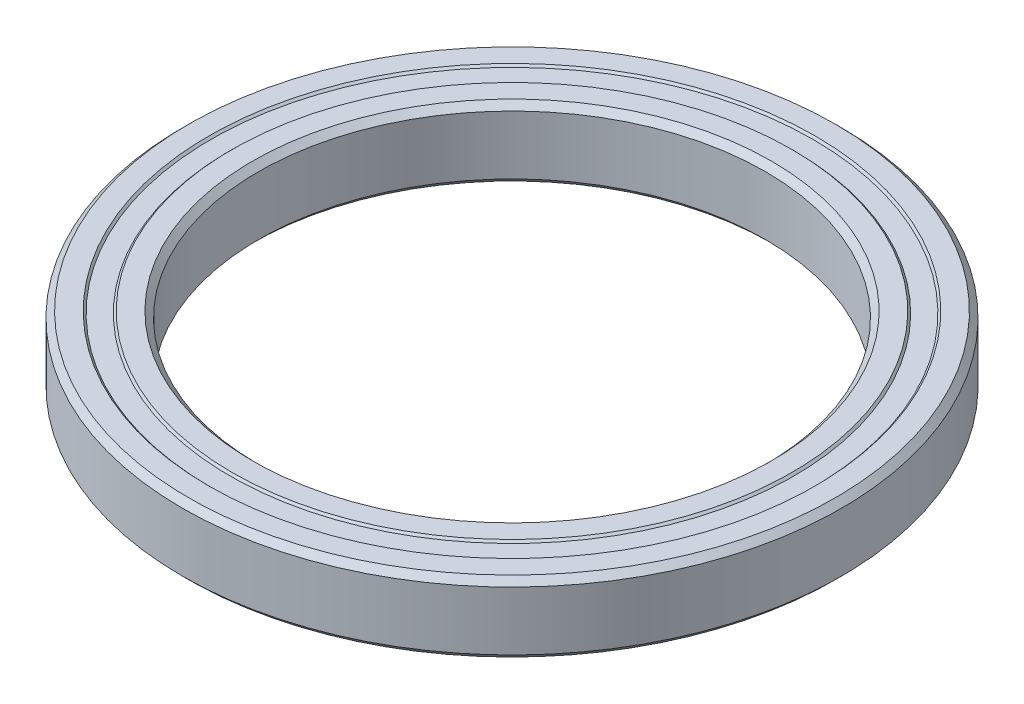
ISO-10303-21;
HEADER;
FILE_DESCRIPTION(('STEP AP214'),'2;1');
FILE_NAME('part.step','',(''),(''),'','','');
FILE_SCHEMA(('AUTOMOTIVE_DESIGN { 1 0 10303 214 1 1 1 1 }'));
ENDSEC;
DATA;
#1=APPLICATION_CONTEXT('core data for automotive mechanical design processes');
#2=APPLICATION_PROTOCOL_DEFINITION('international standard','automotive_design',2000,#1);
#3=PRODUCT_CONTEXT('',#1,'mechanical');
#4=PRODUCT('Part','Part','',(#3));
#5=PRODUCT_RELATED_PRODUCT_CATEGORY('part','',(#4));
#6=PRODUCT_DEFINITION_FORMATION('','',#4);
#7=PRODUCT_DEFINITION_CONTEXT('part definition',#1,'design');
#8=PRODUCT_DEFINITION('design','',#6,#7);
#9=PRODUCT_DEFINITION_SHAPE('','',#8);
#10=(LENGTH_UNIT() NAMED_UNIT(*) SI_UNIT(.MILLI.,.METRE.));
#11=(NAMED_UNIT(*) PLANE_ANGLE_UNIT() SI_UNIT($,.RADIAN.));
#12=(NAMED_UNIT(*) SI_UNIT($,.STERADIAN.) SOLID_ANGLE_UNIT());
#13=UNCERTAINTY_MEASURE_WITH_UNIT(LENGTH_MEASURE(1.E-05),#10,'distance_accuracy_value','');
#14=(GEOMETRIC_REPRESENTATION_CONTEXT(3) GLOBAL_UNCERTAINTY_ASSIGNED_CONTEXT((#13)) GLOBAL_UNIT_ASSIGNED_CONTEXT((#10,
#11,#12)) REPRESENTATION_CONTEXT('',''));
#15=CARTESIAN_POINT('',(0.,0.,0.));
#16=DIRECTION('',(0.,0.,1.));
#17=DIRECTION('',(1.,0.,0.));
#18=AXIS2_PLACEMENT_3D('',#15,#16,#17);
#19=CARTESIAN_POINT('',(0.,3.49999999999999,0.));
#20=DIRECTION('',(0.,1.,0.));
#21=DIRECTION('',(0.,0.,1.));
#22=AXIS2_PLACEMENT_3D('',#19,#20,#21);
#23=CONICAL_SURFACE('',#22,25.6,0.785398163397469);
#24=CARTESIAN_POINT('',(0.,2.90000000000002,0.));
#25=DIRECTION('',(0.,-1.,0.));
#26=DIRECTION('',(0.,0.,-1.));
#27=AXIS2_PLACEMENT_3D('',#24,#25,#26);
#28=CIRCLE('',#27,25.);
#29=CARTESIAN_POINT('',(0.,2.90000000000002,-25.));
#30=VERTEX_POINT('',#29);
#31=EDGE_CURVE('E10',#30,#30,#28,.T.);
#32=ORIENTED_EDGE('',*,*,#31,.T.);
#33=EDGE_LOOP('',(#32));
#34=FACE_BOUND('',#33,.T.);
#35=CARTESIAN_POINT('',(0.,3.49999999999999,0.));
#36=DIRECTION('',(0.,-1.,0.));
#37=DIRECTION('',(0.,0.,-1.));
#38=AXIS2_PLACEMENT_3D('',#35,#36,#37);
#39=CIRCLE('',#38,25.6);
#40=CARTESIAN_POINT('',(0.,3.49999999999999,-25.6));
#41=VERTEX_POINT('',#40);
#42=EDGE_CURVE('E88',#41,#41,#39,.T.);
#43=ORIENTED_EDGE('',*,*,#42,.F.);
#44=EDGE_LOOP('',(#43));
#45=FACE_BOUND('',#44,.T.);
#46=ADVANCED_FACE('F36',(#34,#45),#23,.F.);
#47=CARTESIAN_POINT('',(0.,-1.34942197217015,0.));
#48=DIRECTION('',(0.,-1.,0.));
#49=DIRECTION('',(0.,0.,-1.));
#50=AXIS2_PLACEMENT_3D('',#47,#48,#49);
#51=CYLINDRICAL_SURFACE('',#50,25.);
#52=CARTESIAN_POINT('',(0.,-2.90000000000002,0.));
#53=DIRECTION('',(0.,-1.,0.));
#54=DIRECTION('',(0.,0.,-1.));
#55=AXIS2_PLACEMENT_3D('',#52,#53,#54);
#56=CIRCLE('',#55,25.);
#57=CARTESIAN_POINT('',(0.,-2.90000000000002,-25.));
#58=VERTEX_POINT('',#57);
#59=EDGE_CURVE('E42',#58,#58,#56,.T.);
#60=ORIENTED_EDGE('',*,*,#59,.T.);
#61=EDGE_LOOP('',(#60));
#62=FACE_BOUND('',#61,.T.);
#63=ORIENTED_EDGE('',*,*,#31,.F.);
#64=EDGE_LOOP('',(#63));
#65=FACE_BOUND('',#64,.T.);
#66=ADVANCED_FACE('F96',(#62,#65),#51,.F.);
#67=CARTESIAN_POINT('',(0.,-2.90000000000002,0.));
#68=DIRECTION('',(0.,-1.,0.));
#69=DIRECTION('',(0.,0.,-1.));
#70=AXIS2_PLACEMENT_3D('',#67,#68,#69);
#71=CONICAL_SURFACE('',#70,25.,0.785398163397434);
#72=CARTESIAN_POINT('',(0.,-3.50000000000001,0.));
#73=DIRECTION('',(0.,-1.,0.));
#74=DIRECTION('',(0.,0.,-1.));
#75=AXIS2_PLACEMENT_3D('',#72,#73,#74);
#76=CIRCLE('',#75,25.6);
#77=CARTESIAN_POINT('',(0.,-3.50000000000001,-25.6));
#78=VERTEX_POINT('',#77);
#79=EDGE_CURVE('E46',#78,#78,#76,.T.);
#80=ORIENTED_EDGE('',*,*,#79,.T.);
#81=EDGE_LOOP('',(#80));
#82=FACE_BOUND('',#81,.T.);
#83=ORIENTED_EDGE('',*,*,#59,.F.);
#84=EDGE_LOOP('',(#83));
#85=FACE_BOUND('',#84,.T.);
#86=ADVANCED_FACE('F100',(#82,#85),#71,.F.);
#87=CARTESIAN_POINT('',(25.6,-3.50000000000001,0.));
#88=DIRECTION('',(0.,-1.,0.));
#89=DIRECTION('',(0.,0.,-1.));
#90=AXIS2_PLACEMENT_3D('',#87,#88,#89);
#91=PLANE('',#90);
#92=CARTESIAN_POINT('',(0.,-3.50000000000001,0.));
#93=DIRECTION('',(0.,-1.,0.));
#94=DIRECTION('',(0.,0.,-1.));
#95=AXIS2_PLACEMENT_3D('',#92,#93,#94);
#96=CIRCLE('',#95,27.6);
#97=CARTESIAN_POINT('',(0.,-3.50000000000001,-27.6));
#98=VERTEX_POINT('',#97);
#99=EDGE_CURVE('E50',#98,#98,#96,.T.);
#100=ORIENTED_EDGE('',*,*,#99,.T.);
#101=EDGE_LOOP('',(#100));
#102=FACE_BOUND('',#101,.T.);
#103=ORIENTED_EDGE('',*,*,#79,.F.);
#104=EDGE_LOOP('',(#103));
#105=FACE_BOUND('',#104,.T.);
#106=ADVANCED_FACE('F104',(#102,#105),#91,.T.);
#107=CARTESIAN_POINT('',(0.,-3.50000000000001,0.));
#108=DIRECTION('',(0.,1.,0.));
#109=DIRECTION('',(0.,0.,1.));
#110=AXIS2_PLACEMENT_3D('',#107,#108,#109);
#111=CONICAL_SURFACE('',#110,27.6,0.785398163397404);
#112=CARTESIAN_POINT('',(0.,-3.3,0.));
#113=DIRECTION('',(0.,-1.,0.));
#114=DIRECTION('',(0.,0.,-1.));
#115=AXIS2_PLACEMENT_3D('',#112,#113,#114);
#116=CIRCLE('',#115,27.8);
#117=CARTESIAN_POINT('',(0.,-3.3,-27.8));
#118=VERTEX_POINT('',#117);
#119=EDGE_CURVE('E55',#118,#118,#116,.T.);
#120=ORIENTED_EDGE('',*,*,#119,.T.);
#121=EDGE_LOOP('',(#120));
#122=FACE_BOUND('',#121,.T.);
#123=ORIENTED_EDGE('',*,*,#99,.F.);
#124=EDGE_LOOP('',(#123));
#125=FACE_BOUND('',#124,.T.);
#126=ADVANCED_FACE('F111',(#122,#125),#111,.T.);
#127=CARTESIAN_POINT('',(27.8,-3.3,0.));
#128=DIRECTION('',(0.,-1.,0.));
#129=DIRECTION('',(0.,0.,-1.));
#130=AXIS2_PLACEMENT_3D('',#127,#128,#129);
#131=PLANE('',#130);
#132=CARTESIAN_POINT('',(0.,-3.3,0.));
#133=DIRECTION('',(0.,-1.,0.));
#134=DIRECTION('',(0.,0.,-1.));
#135=AXIS2_PLACEMENT_3D('',#132,#133,#134);
#136=CIRCLE('',#135,29.7);
#137=CARTESIAN_POINT('',(0.,-3.3,-29.7));
#138=VERTEX_POINT('',#137);
#139=EDGE_CURVE('E58',#138,#138,#136,.T.);
#140=ORIENTED_EDGE('',*,*,#139,.T.);
#141=EDGE_LOOP('',(#140));
#142=FACE_BOUND('',#141,.T.);
#143=ORIENTED_EDGE('',*,*,#119,.F.);
#144=EDGE_LOOP('',(#143));
#145=FACE_BOUND('',#144,.T.);
#146=ADVANCED_FACE('F115',(#142,#145),#131,.T.);
#147=CARTESIAN_POINT('',(0.,-3.3,0.));
#148=DIRECTION('',(0.,-1.,0.));
#149=DIRECTION('',(0.,0.,-1.));
#150=AXIS2_PLACEMENT_3D('',#147,#148,#149);
#151=CONICAL_SURFACE('',#150,29.7,0.785398163397396);
#152=CARTESIAN_POINT('',(0.,-3.50000000000001,0.));
#153=DIRECTION('',(0.,-1.,0.));
#154=DIRECTION('',(0.,0.,-1.));
#155=AXIS2_PLACEMENT_3D('',#152,#153,#154);
#156=CIRCLE('',#155,29.9);
#157=CARTESIAN_POINT('',(0.,-3.50000000000001,-29.9));
#158=VERTEX_POINT('',#157);
#159=EDGE_CURVE('E61',#158,#158,#156,.T.);
#160=ORIENTED_EDGE('',*,*,#159,.T.);
#161=EDGE_LOOP('',(#160));
#162=FACE_BOUND('',#161,.T.);
#163=ORIENTED_EDGE('',*,*,#139,.F.);
#164=EDGE_LOOP('',(#163));
#165=FACE_BOUND('',#164,.T.);
#166=ADVANCED_FACE('F119',(#162,#165),#151,.F.);
#167=CARTESIAN_POINT('',(29.9,-3.50000000000001,0.));
#168=DIRECTION('',(0.,-1.,0.));
#169=DIRECTION('',(0.,0.,-1.));
#170=AXIS2_PLACEMENT_3D('',#167,#168,#169);
#171=PLANE('',#170);
#172=CARTESIAN_POINT('',(0.,-3.50000000000001,0.));
#173=DIRECTION('',(0.,-1.,0.));
#174=DIRECTION('',(0.,0.,-1.));
#175=AXIS2_PLACEMENT_3D('',#172,#173,#174);
#176=CIRCLE('',#175,31.9);
#177=CARTESIAN_POINT('',(0.,-3.50000000000001,-31.9));
#178=VERTEX_POINT('',#177);
#179=EDGE_CURVE('E64',#178,#178,#176,.T.);
#180=ORIENTED_EDGE('',*,*,#179,.T.);
#181=EDGE_LOOP('',(#180));
#182=FACE_BOUND('',#181,.T.);
#183=ORIENTED_EDGE('',*,*,#159,.F.);
#184=EDGE_LOOP('',(#183));
#185=FACE_BOUND('',#184,.T.);
#186=ADVANCED_FACE('F123',(#182,#185),#171,.T.);
#187=CARTESIAN_POINT('',(0.,-3.50000000000001,0.));
#188=DIRECTION('',(0.,1.,0.));
#189=DIRECTION('',(0.,0.,1.));
#190=AXIS2_PLACEMENT_3D('',#187,#188,#189);
#191=CONICAL_SURFACE('',#190,31.9,0.785398163397438);
#192=CARTESIAN_POINT('',(0.,-2.90000000000002,0.));
#193=DIRECTION('',(0.,-1.,0.));
#194=DIRECTION('',(0.,0.,-1.));
#195=AXIS2_PLACEMENT_3D('',#192,#193,#194);
#196=CIRCLE('',#195,32.5);
#197=CARTESIAN_POINT('',(0.,-2.90000000000002,-32.5));
#198=VERTEX_POINT('',#197);
#199=EDGE_CURVE('E67',#198,#198,#196,.T.);
#200=ORIENTED_EDGE('',*,*,#199,.T.);
#201=EDGE_LOOP('',(#200));
#202=FACE_BOUND('',#201,.T.);
#203=ORIENTED_EDGE('',*,*,#179,.F.);
#204=EDGE_LOOP('',(#203));
#205=FACE_BOUND('',#204,.T.);
#206=ADVANCED_FACE('F127',(#202,#205),#191,.T.);
#207=CARTESIAN_POINT('',(0.,-1.34942197217015,0.));
#208=DIRECTION('',(0.,-1.,0.));
#209=DIRECTION('',(0.,0.,-1.));
#210=AXIS2_PLACEMENT_3D('',#207,#208,#209);
#211=CYLINDRICAL_SURFACE('',#210,32.5);
#212=CARTESIAN_POINT('',(0.,2.9,0.));
#213=DIRECTION('',(0.,-1.,0.));
#214=DIRECTION('',(0.,0.,-1.));
#215=AXIS2_PLACEMENT_3D('',#212,#213,#214);
#216=CIRCLE('',#215,32.5);
#217=CARTESIAN_POINT('',(0.,2.9,-32.5));
#218=VERTEX_POINT('',#217);
#219=EDGE_CURVE('E70',#218,#218,#216,.T.);
#220=ORIENTED_EDGE('',*,*,#219,.T.);
#221=EDGE_LOOP('',(#220));
#222=FACE_BOUND('',#221,.T.);
#223=ORIENTED_EDGE('',*,*,#199,.F.);
#224=EDGE_LOOP('',(#223));
#225=FACE_BOUND('',#224,.T.);
#226=ADVANCED_FACE('F131',(#222,#225),#211,.T.);
#227=CARTESIAN_POINT('',(0.,2.9,0.));
#228=DIRECTION('',(0.,-1.,0.));
#229=DIRECTION('',(0.,0.,-1.));
#230=AXIS2_PLACEMENT_3D('',#227,#228,#229);
#231=CONICAL_SURFACE('',#230,32.5,0.785398163397444);
#232=CARTESIAN_POINT('',(0.,3.49999999999999,0.));
#233=DIRECTION('',(0.,-1.,0.));
#234=DIRECTION('',(0.,0.,-1.));
#235=AXIS2_PLACEMENT_3D('',#232,#233,#234);
#236=CIRCLE('',#235,31.9);
#237=CARTESIAN_POINT('',(0.,3.49999999999999,-31.9));
#238=VERTEX_POINT('',#237);
#239=EDGE_CURVE('E73',#238,#238,#236,.T.);
#240=ORIENTED_EDGE('',*,*,#239,.T.);
#241=EDGE_LOOP('',(#240));
#242=FACE_BOUND('',#241,.T.);
#243=ORIENTED_EDGE('',*,*,#219,.F.);
#244=EDGE_LOOP('',(#243));
#245=FACE_BOUND('',#244,.T.);
#246=ADVANCED_FACE('F135',(#242,#245),#231,.T.);
#247=CARTESIAN_POINT('',(31.9,3.49999999999999,0.));
#248=DIRECTION('',(0.,1.,0.));
#249=DIRECTION('',(0.,0.,1.));
#250=AXIS2_PLACEMENT_3D('',#247,#248,#249);
#251=PLANE('',#250);
#252=CARTESIAN_POINT('',(0.,3.49999999999999,0.));
#253=DIRECTION('',(0.,-1.,0.));
#254=DIRECTION('',(0.,0.,-1.));
#255=AXIS2_PLACEMENT_3D('',#252,#253,#254);
#256=CIRCLE('',#255,29.9);
#257=CARTESIAN_POINT('',(0.,3.49999999999999,-29.9));
#258=VERTEX_POINT('',#257);
#259=EDGE_CURVE('E76',#258,#258,#256,.T.);
#260=ORIENTED_EDGE('',*,*,#259,.T.);
#261=EDGE_LOOP('',(#260));
#262=FACE_BOUND('',#261,.T.);
#263=ORIENTED_EDGE('',*,*,#239,.F.);
#264=EDGE_LOOP('',(#263));
#265=FACE_BOUND('',#264,.T.);
#266=ADVANCED_FACE('F139',(#262,#265),#251,.T.);
#267=CARTESIAN_POINT('',(0.,3.49999999999999,0.));
#268=DIRECTION('',(0.,1.,0.));
#269=DIRECTION('',(0.,0.,1.));
#270=AXIS2_PLACEMENT_3D('',#267,#268,#269);
#271=CONICAL_SURFACE('',#270,29.9,0.785398163397448);
#272=CARTESIAN_POINT('',(0.,3.29999999999999,0.));
#273=DIRECTION('',(0.,-1.,0.));
#274=DIRECTION('',(0.,0.,-1.));
#275=AXIS2_PLACEMENT_3D('',#272,#273,#274);
#276=CIRCLE('',#275,29.7);
#277=CARTESIAN_POINT('',(0.,3.29999999999999,-29.7));
#278=VERTEX_POINT('',#277);
#279=EDGE_CURVE('E79',#278,#278,#276,.T.);
#280=ORIENTED_EDGE('',*,*,#279,.T.);
#281=EDGE_LOOP('',(#280));
#282=FACE_BOUND('',#281,.T.);
#283=ORIENTED_EDGE('',*,*,#259,.F.);
#284=EDGE_LOOP('',(#283));
#285=FACE_BOUND('',#284,.T.);
#286=ADVANCED_FACE('F143',(#282,#285),#271,.F.);
#287=CARTESIAN_POINT('',(29.7,3.29999999999999,0.));
#288=DIRECTION('',(0.,1.,0.));
#289=DIRECTION('',(0.,0.,1.));
#290=AXIS2_PLACEMENT_3D('',#287,#288,#289);
#291=PLANE('',#290);
#292=CARTESIAN_POINT('',(0.,3.3,0.));
#293=DIRECTION('',(0.,-1.,0.));
#294=DIRECTION('',(0.,0.,-1.));
#295=AXIS2_PLACEMENT_3D('',#292,#293,#294);
#296=CIRCLE('',#295,27.8);
#297=CARTESIAN_POINT('',(0.,3.3,-27.8));
#298=VERTEX_POINT('',#297);
#299=EDGE_CURVE('E82',#298,#298,#296,.T.);
#300=ORIENTED_EDGE('',*,*,#299,.T.);
#301=EDGE_LOOP('',(#300));
#302=FACE_BOUND('',#301,.T.);
#303=ORIENTED_EDGE('',*,*,#279,.F.);
#304=EDGE_LOOP('',(#303));
#305=FACE_BOUND('',#304,.T.);
#306=ADVANCED_FACE('F147',(#302,#305),#291,.T.);
#307=CARTESIAN_POINT('',(0.,3.3,0.));
#308=DIRECTION('',(0.,-1.,0.));
#309=DIRECTION('',(0.,0.,-1.));
#310=AXIS2_PLACEMENT_3D('',#307,#308,#309);
#311=CONICAL_SURFACE('',#310,27.8,0.785398163397461);
#312=CARTESIAN_POINT('',(0.,3.49999999999999,0.));
#313=DIRECTION('',(0.,-1.,0.));
#314=DIRECTION('',(0.,0.,-1.));
#315=AXIS2_PLACEMENT_3D('',#312,#313,#314);
#316=CIRCLE('',#315,27.6);
#317=CARTESIAN_POINT('',(0.,3.49999999999999,-27.6));
#318=VERTEX_POINT('',#317);
#319=EDGE_CURVE('E85',#318,#318,#316,.T.);
#320=ORIENTED_EDGE('',*,*,#319,.T.);
#321=EDGE_LOOP('',(#320));
#322=FACE_BOUND('',#321,.T.);
#323=ORIENTED_EDGE('',*,*,#299,.F.);
#324=EDGE_LOOP('',(#323));
#325=FACE_BOUND('',#324,.T.);
#326=ADVANCED_FACE('F151',(#322,#325),#311,.T.);
#327=CARTESIAN_POINT('',(27.6,3.49999999999999,0.));
#328=DIRECTION('',(0.,1.,0.));
#329=DIRECTION('',(0.,0.,1.));
#330=AXIS2_PLACEMENT_3D('',#327,#328,#329);
#331=PLANE('',#330);
#332=ORIENTED_EDGE('',*,*,#42,.T.);
#333=EDGE_LOOP('',(#332));
#334=FACE_BOUND('',#333,.T.);
#335=ORIENTED_EDGE('',*,*,#319,.F.);
#336=EDGE_LOOP('',(#335));
#337=FACE_BOUND('',#336,.T.);
#338=ADVANCED_FACE('F92',(#334,#337),#331,.T.);
#339=CLOSED_SHELL('',(#46,#66,#86,#106,#126,#146,#166,#186,#206,#226,#246,#266,#286,#306,#326,#338));
#340=MANIFOLD_SOLID_BREP('B2',#339);
#341=ADVANCED_BREP_SHAPE_REPRESENTATION('',(#18,#340),#14);
#342=SHAPE_DEFINITION_REPRESENTATION(#9,#341);
ENDSEC;
END-ISO-10303-21;
